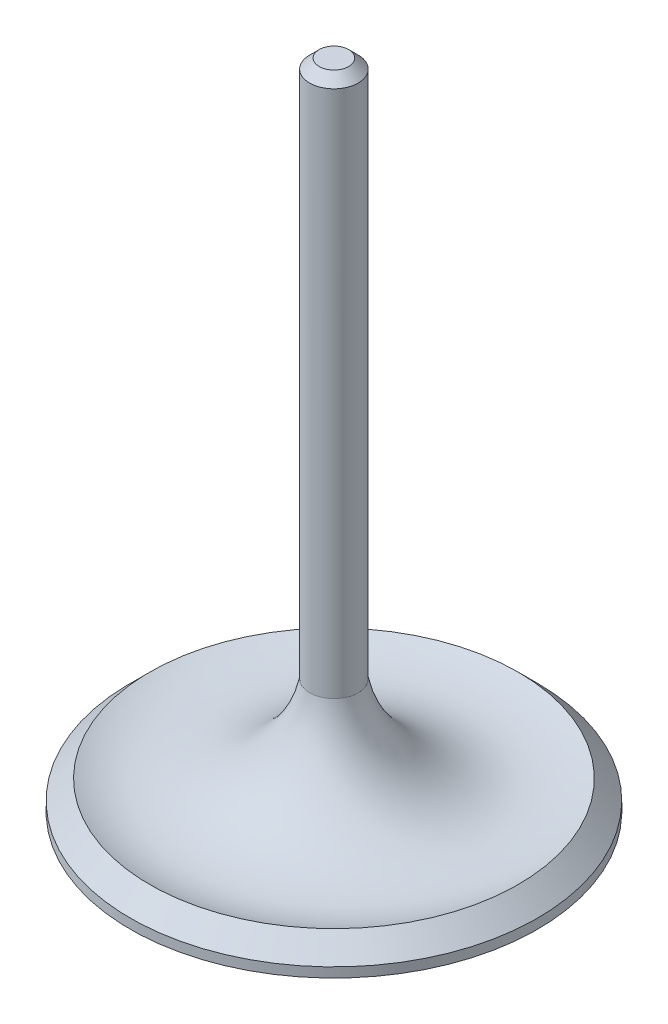
ISO-10303-21;
HEADER;
FILE_DESCRIPTION(('STEP AP214'),'2;1');
FILE_NAME('part.step','',(''),(''),'','','');
FILE_SCHEMA(('AUTOMOTIVE_DESIGN { 1 0 10303 214 1 1 1 1 }'));
ENDSEC;
DATA;
#1=APPLICATION_CONTEXT('core data for automotive mechanical design processes');
#2=APPLICATION_PROTOCOL_DEFINITION('international standard','automotive_design',2000,#1);
#3=PRODUCT_CONTEXT('',#1,'mechanical');
#4=PRODUCT('Part','Part','',(#3));
#5=PRODUCT_RELATED_PRODUCT_CATEGORY('part','',(#4));
#6=PRODUCT_DEFINITION_FORMATION('','',#4);
#7=PRODUCT_DEFINITION_CONTEXT('part definition',#1,'design');
#8=PRODUCT_DEFINITION('design','',#6,#7);
#9=PRODUCT_DEFINITION_SHAPE('','',#8);
#10=(LENGTH_UNIT() NAMED_UNIT(*) SI_UNIT(.MILLI.,.METRE.));
#11=(NAMED_UNIT(*) PLANE_ANGLE_UNIT() SI_UNIT($,.RADIAN.));
#12=(NAMED_UNIT(*) SI_UNIT($,.STERADIAN.) SOLID_ANGLE_UNIT());
#13=UNCERTAINTY_MEASURE_WITH_UNIT(LENGTH_MEASURE(1.E-05),#10,'distance_accuracy_value','');
#14=(GEOMETRIC_REPRESENTATION_CONTEXT(3) GLOBAL_UNCERTAINTY_ASSIGNED_CONTEXT((#13)) GLOBAL_UNIT_ASSIGNED_CONTEXT((#10,
#11,#12)) REPRESENTATION_CONTEXT('',''));
#15=CARTESIAN_POINT('',(0.,0.,0.));
#16=DIRECTION('',(0.,0.,1.));
#17=DIRECTION('',(1.,0.,0.));
#18=AXIS2_PLACEMENT_3D('',#15,#16,#17);
#19=CARTESIAN_POINT('',(0.,0.,-26.67));
#20=DIRECTION('',(0.,-1.,0.));
#21=DIRECTION('',(0.,0.,-1.));
#22=AXIS2_PLACEMENT_3D('',#19,#20,#21);
#23=PLANE('',#22);
#24=CARTESIAN_POINT('',(0.,0.,0.));
#25=DIRECTION('',(0.,-1.,0.));
#26=DIRECTION('',(0.,0.,-1.));
#27=AXIS2_PLACEMENT_3D('',#24,#25,#26);
#28=CIRCLE('',#27,26.67);
#29=CARTESIAN_POINT('',(0.,0.,-26.67));
#30=VERTEX_POINT('',#29);
#31=EDGE_CURVE('E53',#30,#30,#28,.T.);
#32=ORIENTED_EDGE('',*,*,#31,.T.);
#33=EDGE_LOOP('',(#32));
#34=FACE_BOUND('',#33,.T.);
#35=ADVANCED_FACE('F39',(#34),#23,.T.);
#36=CARTESIAN_POINT('',(0.,0.,0.));
#37=DIRECTION('',(0.,-1.,0.));
#38=DIRECTION('',(0.,0.,-1.));
#39=AXIS2_PLACEMENT_3D('',#36,#37,#38);
#40=CYLINDRICAL_SURFACE('',#39,26.67);
#41=CARTESIAN_POINT('',(0.,1.27,0.));
#42=DIRECTION('',(0.,-1.,0.));
#43=DIRECTION('',(0.,0.,-1.));
#44=AXIS2_PLACEMENT_3D('',#41,#42,#43);
#45=CIRCLE('',#44,26.67);
#46=CARTESIAN_POINT('',(0.,1.27,-26.67));
#47=VERTEX_POINT('',#46);
#48=EDGE_CURVE('E58',#47,#47,#45,.T.);
#49=ORIENTED_EDGE('',*,*,#48,.T.);
#50=EDGE_LOOP('',(#49));
#51=FACE_BOUND('',#50,.T.);
#52=ORIENTED_EDGE('',*,*,#31,.F.);
#53=EDGE_LOOP('',(#52));
#54=FACE_BOUND('',#53,.T.);
#55=ADVANCED_FACE('F88',(#51,#54),#40,.T.);
#56=CARTESIAN_POINT('',(0.,1.27,0.));
#57=DIRECTION('',(0.,-1.,0.));
#58=DIRECTION('',(0.,0.,-1.));
#59=AXIS2_PLACEMENT_3D('',#56,#57,#58);
#60=CONICAL_SURFACE('',#59,26.67,0.785398163397454);
#61=CARTESIAN_POINT('',(0.,3.81,0.));
#62=DIRECTION('',(0.,-1.,0.));
#63=DIRECTION('',(0.,0.,-1.));
#64=AXIS2_PLACEMENT_3D('',#61,#62,#63);
#65=CIRCLE('',#64,24.13);
#66=CARTESIAN_POINT('',(0.,3.81,-24.13));
#67=VERTEX_POINT('',#66);
#68=EDGE_CURVE('E64',#67,#67,#65,.T.);
#69=ORIENTED_EDGE('',*,*,#68,.T.);
#70=EDGE_LOOP('',(#69));
#71=FACE_BOUND('',#70,.T.);
#72=ORIENTED_EDGE('',*,*,#48,.F.);
#73=EDGE_LOOP('',(#72));
#74=FACE_BOUND('',#73,.T.);
#75=ADVANCED_FACE('F85',(#71,#74),#60,.T.);
#76=CARTESIAN_POINT('',(0.,17.8512720866883,0.));
#77=DIRECTION('',(0.,-1.,0.));
#78=DIRECTION('',(0.,0.,-1.));
#79=AXIS2_PLACEMENT_3D('',#76,#77,#78);
#80=TOROIDAL_SURFACE('',#79,18.1797749464756,15.25);
#81=CARTESIAN_POINT('',(0.,15.100044805077,0.));
#82=DIRECTION('',(0.,-1.,0.));
#83=DIRECTION('',(0.,0.,-1.));
#84=AXIS2_PLACEMENT_3D('',#81,#82,#83);
#85=CIRCLE('',#84,3.18000000000001);
#86=CARTESIAN_POINT('',(0.,15.100044805077,-3.18000000000001));
#87=VERTEX_POINT('',#86);
#88=EDGE_CURVE('E68',#87,#87,#85,.T.);
#89=ORIENTED_EDGE('',*,*,#88,.T.);
#90=EDGE_LOOP('',(#89));
#91=FACE_BOUND('',#90,.T.);
#92=ORIENTED_EDGE('',*,*,#68,.F.);
#93=EDGE_LOOP('',(#92));
#94=FACE_BOUND('',#93,.T.);
#95=ADVANCED_FACE('F73',(#91,#94),#80,.F.);
#96=CARTESIAN_POINT('',(0.,0.,0.));
#97=DIRECTION('',(0.,-1.,0.));
#98=DIRECTION('',(0.,0.,-1.));
#99=AXIS2_PLACEMENT_3D('',#96,#97,#98);
#100=CYLINDRICAL_SURFACE('',#99,3.18);
#101=CARTESIAN_POINT('',(0.,84.3,0.));
#102=DIRECTION('',(0.,1.,0.));
#103=DIRECTION('',(0.,0.,1.));
#104=AXIS2_PLACEMENT_3D('',#101,#102,#103);
#105=CIRCLE('',#104,3.18);
#106=CARTESIAN_POINT('',(0.,84.3,3.18));
#107=VERTEX_POINT('',#106);
#108=EDGE_CURVE('E48',#107,#107,#105,.F.);
#109=ORIENTED_EDGE('',*,*,#108,.T.);
#110=EDGE_LOOP('',(#109));
#111=FACE_BOUND('',#110,.T.);
#112=ORIENTED_EDGE('',*,*,#88,.F.);
#113=EDGE_LOOP('',(#112));
#114=FACE_BOUND('',#113,.T.);
#115=ADVANCED_FACE('F76',(#111,#114),#100,.T.);
#116=CARTESIAN_POINT('',(0.,85.55,0.));
#117=DIRECTION('',(0.,1.,0.));
#118=DIRECTION('',(0.,0.,1.));
#119=AXIS2_PLACEMENT_3D('',#116,#117,#118);
#120=PLANE('',#119);
#121=CARTESIAN_POINT('',(0.,85.55,0.));
#122=DIRECTION('',(0.,1.,0.));
#123=DIRECTION('',(0.,0.,1.));
#124=AXIS2_PLACEMENT_3D('',#121,#122,#123);
#125=CIRCLE('',#124,1.93000000000002);
#126=CARTESIAN_POINT('',(0.,85.55,1.93000000000002));
#127=VERTEX_POINT('',#126);
#128=EDGE_CURVE('E10',#127,#127,#125,.T.);
#129=ORIENTED_EDGE('',*,*,#128,.T.);
#130=EDGE_LOOP('',(#129));
#131=FACE_BOUND('',#130,.T.);
#132=ADVANCED_FACE('F78',(#131),#120,.T.);
#133=CARTESIAN_POINT('',(0.,84.3,0.));
#134=DIRECTION('',(0.,-1.,0.));
#135=DIRECTION('',(0.,0.,-1.));
#136=AXIS2_PLACEMENT_3D('',#133,#134,#135);
#137=CONICAL_SURFACE('',#136,3.18,0.785398163397443);
#138=ORIENTED_EDGE('',*,*,#128,.F.);
#139=EDGE_LOOP('',(#138));
#140=FACE_BOUND('',#139,.T.);
#141=ORIENTED_EDGE('',*,*,#108,.F.);
#142=EDGE_LOOP('',(#141));
#143=FACE_BOUND('',#142,.T.);
#144=ADVANCED_FACE('F42',(#140,#143),#137,.T.);
#145=CLOSED_SHELL('',(#35,#55,#75,#95,#115,#132,#144));
#146=MANIFOLD_SOLID_BREP('B2',#145);
#147=ADVANCED_BREP_SHAPE_REPRESENTATION('',(#18,#146),#14);
#148=SHAPE_DEFINITION_REPRESENTATION(#9,#147);
ENDSEC;
END-ISO-10303-21;
